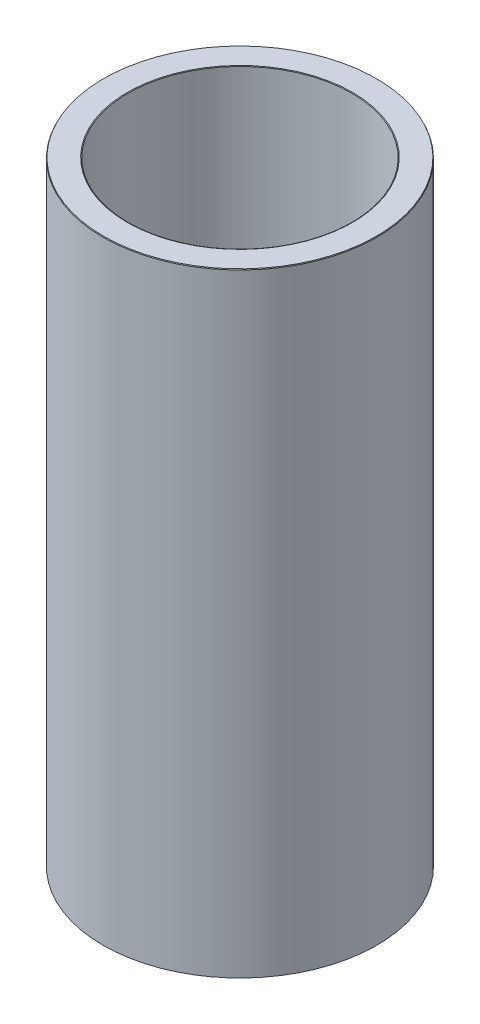
ISO-10303-21;
HEADER;
FILE_DESCRIPTION(('STEP AP214'),'2;1');
FILE_NAME('part.step','',(''),(''),'','','');
FILE_SCHEMA(('AUTOMOTIVE_DESIGN { 1 0 10303 214 1 1 1 1 }'));
ENDSEC;
DATA;
#1=APPLICATION_CONTEXT('core data for automotive mechanical design processes');
#2=APPLICATION_PROTOCOL_DEFINITION('international standard','automotive_design',2000,#1);
#3=PRODUCT_CONTEXT('',#1,'mechanical');
#4=PRODUCT('Part','Part','',(#3));
#5=PRODUCT_RELATED_PRODUCT_CATEGORY('part','',(#4));
#6=PRODUCT_DEFINITION_FORMATION('','',#4);
#7=PRODUCT_DEFINITION_CONTEXT('part definition',#1,'design');
#8=PRODUCT_DEFINITION('design','',#6,#7);
#9=PRODUCT_DEFINITION_SHAPE('','',#8);
#10=(LENGTH_UNIT() NAMED_UNIT(*) SI_UNIT(.MILLI.,.METRE.));
#11=(NAMED_UNIT(*) PLANE_ANGLE_UNIT() SI_UNIT($,.RADIAN.));
#12=(NAMED_UNIT(*) SI_UNIT($,.STERADIAN.) SOLID_ANGLE_UNIT());
#13=UNCERTAINTY_MEASURE_WITH_UNIT(LENGTH_MEASURE(1.E-05),#10,'distance_accuracy_value','');
#14=(GEOMETRIC_REPRESENTATION_CONTEXT(3) GLOBAL_UNCERTAINTY_ASSIGNED_CONTEXT((#13)) GLOBAL_UNIT_ASSIGNED_CONTEXT((#10,
#11,#12)) REPRESENTATION_CONTEXT('',''));
#15=CARTESIAN_POINT('',(0.,0.,0.));
#16=DIRECTION('',(0.,0.,1.));
#17=DIRECTION('',(1.,0.,0.));
#18=AXIS2_PLACEMENT_3D('',#15,#16,#17);
#19=CARTESIAN_POINT('',(0.,235.67672714564,0.));
#20=DIRECTION('',(0.,-1.,0.));
#21=DIRECTION('',(0.,0.,-1.));
#22=AXIS2_PLACEMENT_3D('',#19,#20,#21);
#23=CYLINDRICAL_SURFACE('',#22,52.5);
#24=CARTESIAN_POINT('',(0.,0.146641537904973,0.));
#25=DIRECTION('',(0.,1.,0.));
#26=DIRECTION('',(0.,0.,1.));
#27=AXIS2_PLACEMENT_3D('',#24,#25,#26);
#28=CIRCLE('',#27,52.5);
#29=CARTESIAN_POINT('',(0.,0.146641537904973,52.5));
#30=VERTEX_POINT('',#29);
#31=EDGE_CURVE('E10',#30,#30,#28,.T.);
#32=ORIENTED_EDGE('',*,*,#31,.T.);
#33=EDGE_LOOP('',(#32));
#34=FACE_BOUND('',#33,.T.);
#35=CARTESIAN_POINT('',(0.,235.385122663347,0.));
#36=DIRECTION('',(0.,1.,0.));
#37=DIRECTION('',(0.,0.,1.));
#38=AXIS2_PLACEMENT_3D('',#35,#36,#37);
#39=CIRCLE('',#38,52.5);
#40=CARTESIAN_POINT('',(0.,235.385122663347,52.5));
#41=VERTEX_POINT('',#40);
#42=EDGE_CURVE('E50',#41,#41,#39,.F.);
#43=ORIENTED_EDGE('',*,*,#42,.T.);
#44=EDGE_LOOP('',(#43));
#45=FACE_BOUND('',#44,.T.);
#46=ADVANCED_FACE('F39',(#34,#45),#23,.T.);
#47=CARTESIAN_POINT('',(0.,235.67672714564,0.));
#48=DIRECTION('',(0.,1.,0.));
#49=DIRECTION('',(0.,0.,1.));
#50=AXIS2_PLACEMENT_3D('',#47,#48,#49);
#51=PLANE('',#50);
#52=CARTESIAN_POINT('',(0.,235.67672714564,0.));
#53=DIRECTION('',(0.,1.,0.));
#54=DIRECTION('',(0.,0.,1.));
#55=AXIS2_PLACEMENT_3D('',#52,#53,#54);
#56=CIRCLE('',#55,43.2210308378446);
#57=CARTESIAN_POINT('',(0.,235.67672714564,43.2210308378446));
#58=VERTEX_POINT('',#57);
#59=EDGE_CURVE('E58',#58,#58,#56,.F.);
#60=ORIENTED_EDGE('',*,*,#59,.T.);
#61=EDGE_LOOP('',(#60));
#62=FACE_BOUND('',#61,.T.);
#63=CARTESIAN_POINT('',(0.,235.67672714564,0.));
#64=DIRECTION('',(0.,1.,0.));
#65=DIRECTION('',(0.,0.,1.));
#66=AXIS2_PLACEMENT_3D('',#63,#64,#65);
#67=CIRCLE('',#66,52.353358462095);
#68=CARTESIAN_POINT('',(0.,235.67672714564,52.353358462095));
#69=VERTEX_POINT('',#68);
#70=EDGE_CURVE('E61',#69,#69,#67,.T.);
#71=ORIENTED_EDGE('',*,*,#70,.T.);
#72=EDGE_LOOP('',(#71));
#73=FACE_BOUND('',#72,.T.);
#74=ADVANCED_FACE('F88',(#62,#73),#51,.T.);
#75=CARTESIAN_POINT('',(0.,0.,0.));
#76=DIRECTION('',(0.,1.,0.));
#77=DIRECTION('',(0.,0.,1.));
#78=AXIS2_PLACEMENT_3D('',#75,#76,#77);
#79=PLANE('',#78);
#80=CARTESIAN_POINT('',(0.,0.,0.));
#81=DIRECTION('',(0.,1.,0.));
#82=DIRECTION('',(0.,0.,1.));
#83=AXIS2_PLACEMENT_3D('',#80,#81,#82);
#84=CIRCLE('',#83,43.0760678934569);
#85=CARTESIAN_POINT('',(0.,0.,43.0760678934569));
#86=VERTEX_POINT('',#85);
#87=EDGE_CURVE('E51',#86,#86,#84,.T.);
#88=ORIENTED_EDGE('',*,*,#87,.T.);
#89=EDGE_LOOP('',(#88));
#90=FACE_BOUND('',#89,.T.);
#91=CARTESIAN_POINT('',(0.,0.,0.));
#92=DIRECTION('',(0.,1.,0.));
#93=DIRECTION('',(0.,0.,1.));
#94=AXIS2_PLACEMENT_3D('',#91,#92,#93);
#95=CIRCLE('',#94,52.2083955177072);
#96=CARTESIAN_POINT('',(0.,0.,52.2083955177072));
#97=VERTEX_POINT('',#96);
#98=EDGE_CURVE('E54',#97,#97,#95,.F.);
#99=ORIENTED_EDGE('',*,*,#98,.T.);
#100=EDGE_LOOP('',(#99));
#101=FACE_BOUND('',#100,.T.);
#102=ADVANCED_FACE('F83',(#90,#101),#79,.F.);
#103=CARTESIAN_POINT('',(0.,235.67672714564,0.));
#104=DIRECTION('',(0.,-1.,0.));
#105=DIRECTION('',(0.,0.,-1.));
#106=AXIS2_PLACEMENT_3D('',#103,#104,#105);
#107=CYLINDRICAL_SURFACE('',#106,42.9294263555519);
#108=CARTESIAN_POINT('',(0.,235.530085607735,0.));
#109=DIRECTION('',(0.,1.,0.));
#110=DIRECTION('',(0.,0.,1.));
#111=AXIS2_PLACEMENT_3D('',#108,#109,#110);
#112=CIRCLE('',#111,42.9294263555519);
#113=CARTESIAN_POINT('',(0.,235.530085607735,42.9294263555519));
#114=VERTEX_POINT('',#113);
#115=EDGE_CURVE('E67',#114,#114,#112,.T.);
#116=ORIENTED_EDGE('',*,*,#115,.T.);
#117=EDGE_LOOP('',(#116));
#118=FACE_BOUND('',#117,.T.);
#119=CARTESIAN_POINT('',(0.,0.291604482292651,0.));
#120=DIRECTION('',(0.,1.,0.));
#121=DIRECTION('',(0.,0.,1.));
#122=AXIS2_PLACEMENT_3D('',#119,#120,#121);
#123=CIRCLE('',#122,42.9294263555519);
#124=CARTESIAN_POINT('',(0.,0.291604482292651,42.9294263555519));
#125=VERTEX_POINT('',#124);
#126=EDGE_CURVE('E69',#125,#125,#123,.F.);
#127=ORIENTED_EDGE('',*,*,#126,.T.);
#128=EDGE_LOOP('',(#127));
#129=FACE_BOUND('',#128,.T.);
#130=ADVANCED_FACE('F71',(#118,#129),#107,.F.);
#131=CARTESIAN_POINT('',(0.,235.530085607735,0.));
#132=DIRECTION('',(0.,1.,0.));
#133=DIRECTION('',(0.,0.,1.));
#134=AXIS2_PLACEMENT_3D('',#131,#132,#133);
#135=CONICAL_SURFACE('',#134,42.9294263555519,1.10484880767316);
#136=ORIENTED_EDGE('',*,*,#59,.F.);
#137=EDGE_LOOP('',(#136));
#138=FACE_BOUND('',#137,.T.);
#139=ORIENTED_EDGE('',*,*,#115,.F.);
#140=EDGE_LOOP('',(#139));
#141=FACE_BOUND('',#140,.T.);
#142=ADVANCED_FACE('F77',(#138,#141),#135,.F.);
#143=CARTESIAN_POINT('',(0.,0.,0.));
#144=DIRECTION('',(0.,-1.,0.));
#145=DIRECTION('',(0.,0.,-1.));
#146=AXIS2_PLACEMENT_3D('',#143,#144,#145);
#147=CONICAL_SURFACE('',#146,43.0760678934569,0.465947519121864);
#148=ORIENTED_EDGE('',*,*,#126,.F.);
#149=EDGE_LOOP('',(#148));
#150=FACE_BOUND('',#149,.T.);
#151=ORIENTED_EDGE('',*,*,#87,.F.);
#152=EDGE_LOOP('',(#151));
#153=FACE_BOUND('',#152,.T.);
#154=ADVANCED_FACE('F73',(#150,#153),#147,.F.);
#155=CARTESIAN_POINT('',(0.,0.146641537904973,0.));
#156=DIRECTION('',(0.,1.,0.));
#157=DIRECTION('',(0.,0.,1.));
#158=AXIS2_PLACEMENT_3D('',#155,#156,#157);
#159=CONICAL_SURFACE('',#158,52.5,1.10484880767314);
#160=ORIENTED_EDGE('',*,*,#98,.F.);
#161=EDGE_LOOP('',(#160));
#162=FACE_BOUND('',#161,.T.);
#163=ORIENTED_EDGE('',*,*,#31,.F.);
#164=EDGE_LOOP('',(#163));
#165=FACE_BOUND('',#164,.T.);
#166=ADVANCED_FACE('F76',(#162,#165),#159,.T.);
#167=CARTESIAN_POINT('',(0.,235.67672714564,0.));
#168=DIRECTION('',(0.,-1.,0.));
#169=DIRECTION('',(0.,0.,-1.));
#170=AXIS2_PLACEMENT_3D('',#167,#168,#169);
#171=CONICAL_SURFACE('',#170,52.353358462095,0.465947519121864);
#172=ORIENTED_EDGE('',*,*,#42,.F.);
#173=EDGE_LOOP('',(#172));
#174=FACE_BOUND('',#173,.T.);
#175=ORIENTED_EDGE('',*,*,#70,.F.);
#176=EDGE_LOOP('',(#175));
#177=FACE_BOUND('',#176,.T.);
#178=ADVANCED_FACE('F45',(#174,#177),#171,.T.);
#179=CLOSED_SHELL('',(#46,#74,#102,#130,#142,#154,#166,#178));
#180=MANIFOLD_SOLID_BREP('B2',#179);
#181=ADVANCED_BREP_SHAPE_REPRESENTATION('',(#18,#180),#14);
#182=SHAPE_DEFINITION_REPRESENTATION(#9,#181);
ENDSEC;
END-ISO-10303-21;
